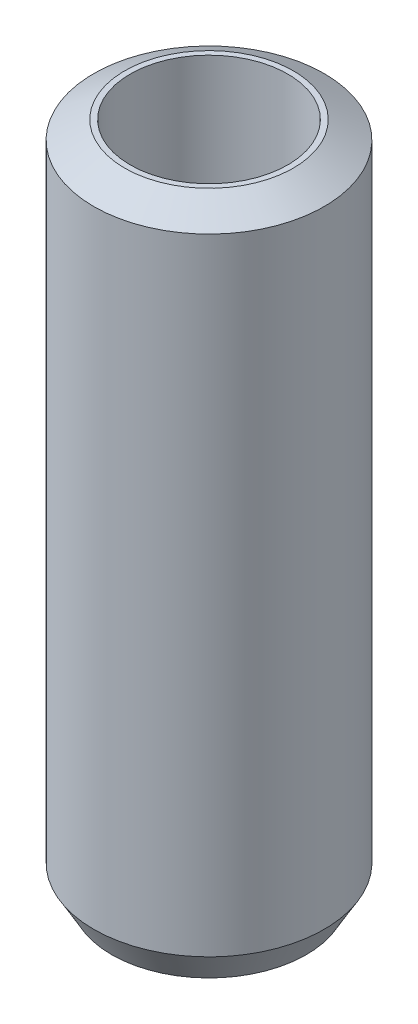
ISO-10303-21;
HEADER;
FILE_DESCRIPTION(('STEP AP214'),'2;1');
FILE_NAME('part.step','',(''),(''),'','','');
FILE_SCHEMA(('AUTOMOTIVE_DESIGN { 1 0 10303 214 1 1 1 1 }'));
ENDSEC;
DATA;
#1=APPLICATION_CONTEXT('core data for automotive mechanical design processes');
#2=APPLICATION_PROTOCOL_DEFINITION('international standard','automotive_design',2000,#1);
#3=PRODUCT_CONTEXT('',#1,'mechanical');
#4=PRODUCT('Part','Part','',(#3));
#5=PRODUCT_RELATED_PRODUCT_CATEGORY('part','',(#4));
#6=PRODUCT_DEFINITION_FORMATION('','',#4);
#7=PRODUCT_DEFINITION_CONTEXT('part definition',#1,'design');
#8=PRODUCT_DEFINITION('design','',#6,#7);
#9=PRODUCT_DEFINITION_SHAPE('','',#8);
#10=(LENGTH_UNIT() NAMED_UNIT(*) SI_UNIT(.MILLI.,.METRE.));
#11=(NAMED_UNIT(*) PLANE_ANGLE_UNIT() SI_UNIT($,.RADIAN.));
#12=(NAMED_UNIT(*) SI_UNIT($,.STERADIAN.) SOLID_ANGLE_UNIT());
#13=UNCERTAINTY_MEASURE_WITH_UNIT(LENGTH_MEASURE(1.E-05),#10,'distance_accuracy_value','');
#14=(GEOMETRIC_REPRESENTATION_CONTEXT(3) GLOBAL_UNCERTAINTY_ASSIGNED_CONTEXT((#13)) GLOBAL_UNIT_ASSIGNED_CONTEXT((#10,
#11,#12)) REPRESENTATION_CONTEXT('',''));
#15=CARTESIAN_POINT('',(0.,0.,0.));
#16=DIRECTION('',(0.,0.,1.));
#17=DIRECTION('',(1.,0.,0.));
#18=AXIS2_PLACEMENT_3D('',#15,#16,#17);
#19=CARTESIAN_POINT('',(0.,58.5578530470989,0.));
#20=DIRECTION('',(0.,-1.,0.));
#21=DIRECTION('',(0.,0.,-1.));
#22=AXIS2_PLACEMENT_3D('',#19,#20,#21);
#23=CYLINDRICAL_SURFACE('',#22,10.);
#24=CARTESIAN_POINT('',(0.,57.0108000993733,0.));
#25=DIRECTION('',(0.,1.,0.));
#26=DIRECTION('',(0.,0.,1.));
#27=AXIS2_PLACEMENT_3D('',#24,#25,#26);
#28=CIRCLE('',#27,10.);
#29=CARTESIAN_POINT('',(0.,57.0108000993733,10.));
#30=VERTEX_POINT('',#29);
#31=EDGE_CURVE('E50',#30,#30,#28,.F.);
#32=ORIENTED_EDGE('',*,*,#31,.T.);
#33=EDGE_LOOP('',(#32));
#34=FACE_BOUND('',#33,.T.);
#35=CARTESIAN_POINT('',(0.,2.67957430745988,0.));
#36=DIRECTION('',(0.,1.,0.));
#37=DIRECTION('',(0.,0.,1.));
#38=AXIS2_PLACEMENT_3D('',#35,#36,#37);
#39=CIRCLE('',#38,10.);
#40=CARTESIAN_POINT('',(0.,2.67957430745988,10.));
#41=VERTEX_POINT('',#40);
#42=EDGE_CURVE('E51',#41,#41,#39,.T.);
#43=ORIENTED_EDGE('',*,*,#42,.T.);
#44=EDGE_LOOP('',(#43));
#45=FACE_BOUND('',#44,.T.);
#46=ADVANCED_FACE('F39',(#34,#45),#23,.T.);
#47=CARTESIAN_POINT('',(0.,58.5578530470989,0.));
#48=DIRECTION('',(0.,1.,0.));
#49=DIRECTION('',(0.,0.,1.));
#50=AXIS2_PLACEMENT_3D('',#47,#48,#49);
#51=PLANE('',#50);
#52=CARTESIAN_POINT('',(0.,58.5578530470989,0.));
#53=DIRECTION('',(0.,1.,0.));
#54=DIRECTION('',(0.,0.,1.));
#55=AXIS2_PLACEMENT_3D('',#52,#53,#54);
#56=CIRCLE('',#55,7.32042569254011);
#57=CARTESIAN_POINT('',(0.,58.5578530470989,7.32042569254011));
#58=VERTEX_POINT('',#57);
#59=EDGE_CURVE('E54',#58,#58,#56,.T.);
#60=ORIENTED_EDGE('',*,*,#59,.T.);
#61=EDGE_LOOP('',(#60));
#62=FACE_BOUND('',#61,.T.);
#63=CARTESIAN_POINT('',(0.,58.5578530470989,0.));
#64=DIRECTION('',(0.,1.,0.));
#65=DIRECTION('',(0.,0.,1.));
#66=AXIS2_PLACEMENT_3D('',#63,#64,#65);
#67=CIRCLE('',#66,6.83821322087587);
#68=CARTESIAN_POINT('',(0.,58.5578530470989,6.83821322087587));
#69=VERTEX_POINT('',#68);
#70=EDGE_CURVE('E58',#69,#69,#67,.T.);
#71=ORIENTED_EDGE('',*,*,#70,.F.);
#72=EDGE_LOOP('',(#71));
#73=FACE_BOUND('',#72,.T.);
#74=ADVANCED_FACE('F69',(#62,#73),#51,.T.);
#75=CARTESIAN_POINT('',(0.,0.,0.));
#76=DIRECTION('',(0.,1.,0.));
#77=DIRECTION('',(0.,0.,1.));
#78=AXIS2_PLACEMENT_3D('',#75,#76,#77);
#79=PLANE('',#78);
#80=CARTESIAN_POINT('',(0.,0.,0.));
#81=DIRECTION('',(0.,1.,0.));
#82=DIRECTION('',(0.,0.,1.));
#83=AXIS2_PLACEMENT_3D('',#80,#81,#82);
#84=CIRCLE('',#83,8.45294705227442);
#85=CARTESIAN_POINT('',(0.,0.,8.45294705227442));
#86=VERTEX_POINT('',#85);
#87=EDGE_CURVE('E10',#86,#86,#84,.F.);
#88=ORIENTED_EDGE('',*,*,#87,.T.);
#89=EDGE_LOOP('',(#88));
#90=FACE_BOUND('',#89,.T.);
#91=CARTESIAN_POINT('',(0.,0.,0.));
#92=DIRECTION('',(0.,1.,0.));
#93=DIRECTION('',(0.,0.,1.));
#94=AXIS2_PLACEMENT_3D('',#91,#92,#93);
#95=CIRCLE('',#94,6.83821322087587);
#96=CARTESIAN_POINT('',(0.,0.,6.83821322087587));
#97=VERTEX_POINT('',#96);
#98=EDGE_CURVE('E63',#97,#97,#95,.T.);
#99=ORIENTED_EDGE('',*,*,#98,.T.);
#100=EDGE_LOOP('',(#99));
#101=FACE_BOUND('',#100,.T.);
#102=ADVANCED_FACE('F75',(#90,#101),#79,.F.);
#103=CARTESIAN_POINT('',(0.,58.5578530470989,0.));
#104=DIRECTION('',(0.,-1.,0.));
#105=DIRECTION('',(0.,0.,-1.));
#106=AXIS2_PLACEMENT_3D('',#103,#104,#105);
#107=CYLINDRICAL_SURFACE('',#106,6.83821322087587);
#108=ORIENTED_EDGE('',*,*,#70,.T.);
#109=EDGE_LOOP('',(#108));
#110=FACE_BOUND('',#109,.T.);
#111=ORIENTED_EDGE('',*,*,#98,.F.);
#112=EDGE_LOOP('',(#111));
#113=FACE_BOUND('',#112,.T.);
#114=ADVANCED_FACE('F70',(#110,#113),#107,.F.);
#115=CARTESIAN_POINT('',(0.,58.5578530470989,0.));
#116=DIRECTION('',(0.,-1.,0.));
#117=DIRECTION('',(0.,0.,-1.));
#118=AXIS2_PLACEMENT_3D('',#115,#116,#117);
#119=CONICAL_SURFACE('',#118,7.32042569254011,1.04719755119659);
#120=ORIENTED_EDGE('',*,*,#31,.F.);
#121=EDGE_LOOP('',(#120));
#122=FACE_BOUND('',#121,.T.);
#123=ORIENTED_EDGE('',*,*,#59,.F.);
#124=EDGE_LOOP('',(#123));
#125=FACE_BOUND('',#124,.T.);
#126=ADVANCED_FACE('F81',(#122,#125),#119,.T.);
#127=CARTESIAN_POINT('',(0.,2.67957430745988,0.));
#128=DIRECTION('',(0.,1.,0.));
#129=DIRECTION('',(0.,0.,1.));
#130=AXIS2_PLACEMENT_3D('',#127,#128,#129);
#131=CONICAL_SURFACE('',#130,10.,0.523598775598302);
#132=ORIENTED_EDGE('',*,*,#87,.F.);
#133=EDGE_LOOP('',(#132));
#134=FACE_BOUND('',#133,.T.);
#135=ORIENTED_EDGE('',*,*,#42,.F.);
#136=EDGE_LOOP('',(#135));
#137=FACE_BOUND('',#136,.T.);
#138=ADVANCED_FACE('F45',(#134,#137),#131,.T.);
#139=CLOSED_SHELL('',(#46,#74,#102,#114,#126,#138));
#140=MANIFOLD_SOLID_BREP('B2',#139);
#141=ADVANCED_BREP_SHAPE_REPRESENTATION('',(#18,#140),#14);
#142=SHAPE_DEFINITION_REPRESENTATION(#9,#141);
ENDSEC;
END-ISO-10303-21;
